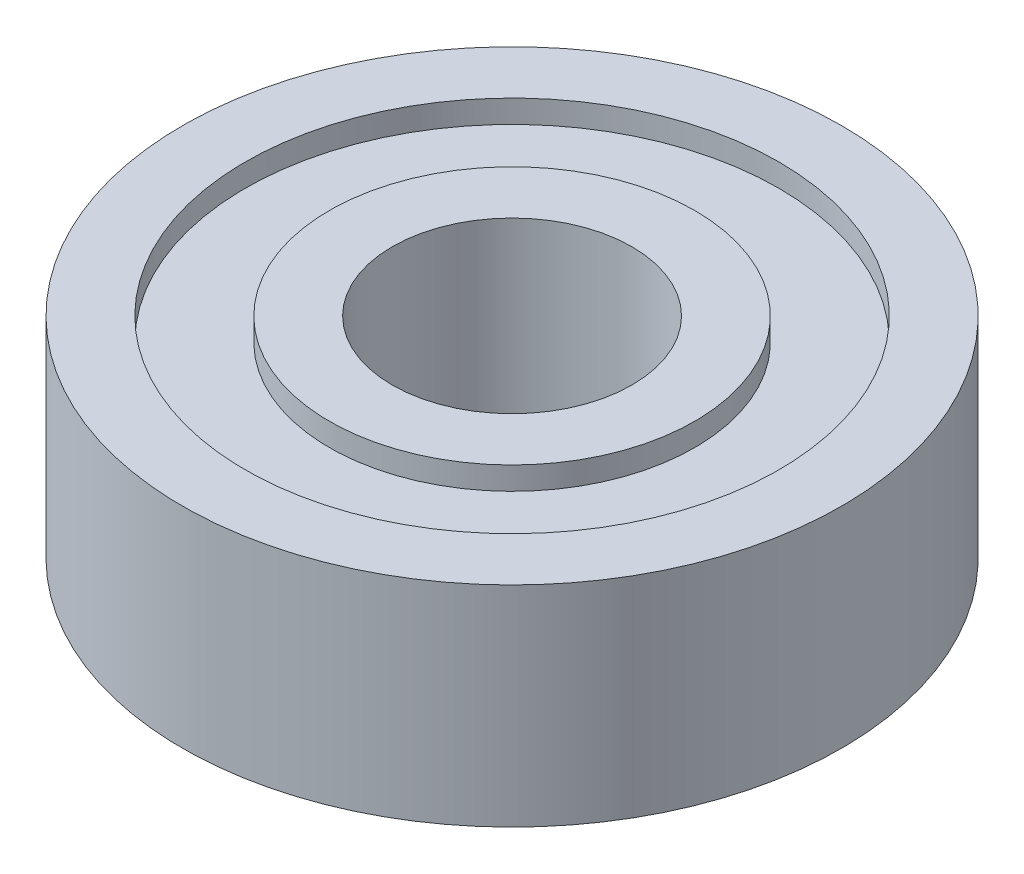
ISO-10303-21;
HEADER;
FILE_DESCRIPTION(('STEP AP214'),'2;1');
FILE_NAME('part.step','',(''),(''),'','','');
FILE_SCHEMA(('AUTOMOTIVE_DESIGN { 1 0 10303 214 1 1 1 1 }'));
ENDSEC;
DATA;
#1=APPLICATION_CONTEXT('core data for automotive mechanical design processes');
#2=APPLICATION_PROTOCOL_DEFINITION('international standard','automotive_design',2000,#1);
#3=PRODUCT_CONTEXT('',#1,'mechanical');
#4=PRODUCT('Part','Part','',(#3));
#5=PRODUCT_RELATED_PRODUCT_CATEGORY('part','',(#4));
#6=PRODUCT_DEFINITION_FORMATION('','',#4);
#7=PRODUCT_DEFINITION_CONTEXT('part definition',#1,'design');
#8=PRODUCT_DEFINITION('design','',#6,#7);
#9=PRODUCT_DEFINITION_SHAPE('','',#8);
#10=(LENGTH_UNIT() NAMED_UNIT(*) SI_UNIT(.MILLI.,.METRE.));
#11=(NAMED_UNIT(*) PLANE_ANGLE_UNIT() SI_UNIT($,.RADIAN.));
#12=(NAMED_UNIT(*) SI_UNIT($,.STERADIAN.) SOLID_ANGLE_UNIT());
#13=UNCERTAINTY_MEASURE_WITH_UNIT(LENGTH_MEASURE(1.E-05),#10,'distance_accuracy_value','');
#14=(GEOMETRIC_REPRESENTATION_CONTEXT(3) GLOBAL_UNCERTAINTY_ASSIGNED_CONTEXT((#13)) GLOBAL_UNIT_ASSIGNED_CONTEXT((#10,
#11,#12)) REPRESENTATION_CONTEXT('',''));
#15=CARTESIAN_POINT('',(0.,0.,0.));
#16=DIRECTION('',(0.,0.,1.));
#17=DIRECTION('',(1.,0.,0.));
#18=AXIS2_PLACEMENT_3D('',#15,#16,#17);
#19=CARTESIAN_POINT('',(6.096,-3.5,0.));
#20=DIRECTION('',(0.,-1.,0.));
#21=DIRECTION('',(0.,0.,-1.));
#22=AXIS2_PLACEMENT_3D('',#19,#20,#21);
#23=PLANE('',#22);
#24=CARTESIAN_POINT('',(0.,-3.5,0.));
#25=DIRECTION('',(0.,-1.,0.));
#26=DIRECTION('',(0.,0.,-1.));
#27=AXIS2_PLACEMENT_3D('',#24,#25,#26);
#28=CIRCLE('',#27,6.096);
#29=CARTESIAN_POINT('',(0.,-3.5,-6.096));
#30=VERTEX_POINT('',#29);
#31=EDGE_CURVE('E10',#30,#30,#28,.T.);
#32=ORIENTED_EDGE('',*,*,#31,.T.);
#33=EDGE_LOOP('',(#32));
#34=FACE_BOUND('',#33,.T.);
#35=CARTESIAN_POINT('',(0.,-3.5,0.));
#36=DIRECTION('',(0.,-1.,0.));
#37=DIRECTION('',(0.,0.,-1.));
#38=AXIS2_PLACEMENT_3D('',#35,#36,#37);
#39=CIRCLE('',#38,4.);
#40=CARTESIAN_POINT('',(0.,-3.5,-4.));
#41=VERTEX_POINT('',#40);
#42=EDGE_CURVE('E76',#41,#41,#39,.T.);
#43=ORIENTED_EDGE('',*,*,#42,.F.);
#44=EDGE_LOOP('',(#43));
#45=FACE_BOUND('',#44,.T.);
#46=ADVANCED_FACE('F36',(#34,#45),#23,.T.);
#47=CARTESIAN_POINT('',(0.,0.,0.));
#48=DIRECTION('',(0.,-1.,0.));
#49=DIRECTION('',(0.,0.,-1.));
#50=AXIS2_PLACEMENT_3D('',#47,#48,#49);
#51=CYLINDRICAL_SURFACE('',#50,6.096);
#52=CARTESIAN_POINT('',(0.,-2.738,0.));
#53=DIRECTION('',(0.,-1.,0.));
#54=DIRECTION('',(0.,0.,-1.));
#55=AXIS2_PLACEMENT_3D('',#52,#53,#54);
#56=CIRCLE('',#55,6.096);
#57=CARTESIAN_POINT('',(0.,-2.738,-6.096));
#58=VERTEX_POINT('',#57);
#59=EDGE_CURVE('E42',#58,#58,#56,.T.);
#60=ORIENTED_EDGE('',*,*,#59,.T.);
#61=EDGE_LOOP('',(#60));
#62=FACE_BOUND('',#61,.T.);
#63=ORIENTED_EDGE('',*,*,#31,.F.);
#64=EDGE_LOOP('',(#63));
#65=FACE_BOUND('',#64,.T.);
#66=ADVANCED_FACE('F84',(#62,#65),#51,.T.);
#67=CARTESIAN_POINT('',(8.904,-2.738,0.));
#68=DIRECTION('',(0.,-1.,0.));
#69=DIRECTION('',(0.,0.,-1.));
#70=AXIS2_PLACEMENT_3D('',#67,#68,#69);
#71=PLANE('',#70);
#72=CARTESIAN_POINT('',(0.,-2.738,0.));
#73=DIRECTION('',(0.,-1.,0.));
#74=DIRECTION('',(0.,0.,-1.));
#75=AXIS2_PLACEMENT_3D('',#72,#73,#74);
#76=CIRCLE('',#75,8.904);
#77=CARTESIAN_POINT('',(0.,-2.738,-8.904));
#78=VERTEX_POINT('',#77);
#79=EDGE_CURVE('E46',#78,#78,#76,.T.);
#80=ORIENTED_EDGE('',*,*,#79,.T.);
#81=EDGE_LOOP('',(#80));
#82=FACE_BOUND('',#81,.T.);
#83=ORIENTED_EDGE('',*,*,#59,.F.);
#84=EDGE_LOOP('',(#83));
#85=FACE_BOUND('',#84,.T.);
#86=ADVANCED_FACE('F88',(#82,#85),#71,.T.);
#87=CARTESIAN_POINT('',(0.,0.,0.));
#88=DIRECTION('',(0.,-1.,0.));
#89=DIRECTION('',(0.,0.,-1.));
#90=AXIS2_PLACEMENT_3D('',#87,#88,#89);
#91=CYLINDRICAL_SURFACE('',#90,8.904);
#92=CARTESIAN_POINT('',(0.,-3.5,0.));
#93=DIRECTION('',(0.,-1.,0.));
#94=DIRECTION('',(0.,0.,-1.));
#95=AXIS2_PLACEMENT_3D('',#92,#93,#94);
#96=CIRCLE('',#95,8.904);
#97=CARTESIAN_POINT('',(0.,-3.5,-8.904));
#98=VERTEX_POINT('',#97);
#99=EDGE_CURVE('E50',#98,#98,#96,.T.);
#100=ORIENTED_EDGE('',*,*,#99,.T.);
#101=EDGE_LOOP('',(#100));
#102=FACE_BOUND('',#101,.T.);
#103=ORIENTED_EDGE('',*,*,#79,.F.);
#104=EDGE_LOOP('',(#103));
#105=FACE_BOUND('',#104,.T.);
#106=ADVANCED_FACE('F92',(#102,#105),#91,.F.);
#107=CARTESIAN_POINT('',(11.,-3.5,0.));
#108=DIRECTION('',(0.,-1.,0.));
#109=DIRECTION('',(0.,0.,-1.));
#110=AXIS2_PLACEMENT_3D('',#107,#108,#109);
#111=PLANE('',#110);
#112=CARTESIAN_POINT('',(0.,-3.5,0.));
#113=DIRECTION('',(0.,-1.,0.));
#114=DIRECTION('',(0.,0.,-1.));
#115=AXIS2_PLACEMENT_3D('',#112,#113,#114);
#116=CIRCLE('',#115,11.);
#117=CARTESIAN_POINT('',(0.,-3.5,-11.));
#118=VERTEX_POINT('',#117);
#119=EDGE_CURVE('E55',#118,#118,#116,.T.);
#120=ORIENTED_EDGE('',*,*,#119,.T.);
#121=EDGE_LOOP('',(#120));
#122=FACE_BOUND('',#121,.T.);
#123=ORIENTED_EDGE('',*,*,#99,.F.);
#124=EDGE_LOOP('',(#123));
#125=FACE_BOUND('',#124,.T.);
#126=ADVANCED_FACE('F99',(#122,#125),#111,.T.);
#127=CARTESIAN_POINT('',(0.,0.,0.));
#128=DIRECTION('',(0.,-1.,0.));
#129=DIRECTION('',(0.,0.,-1.));
#130=AXIS2_PLACEMENT_3D('',#127,#128,#129);
#131=CYLINDRICAL_SURFACE('',#130,11.);
#132=CARTESIAN_POINT('',(0.,3.5,0.));
#133=DIRECTION('',(0.,-1.,0.));
#134=DIRECTION('',(0.,0.,-1.));
#135=AXIS2_PLACEMENT_3D('',#132,#133,#134);
#136=CIRCLE('',#135,11.);
#137=CARTESIAN_POINT('',(0.,3.5,-11.));
#138=VERTEX_POINT('',#137);
#139=EDGE_CURVE('E58',#138,#138,#136,.T.);
#140=ORIENTED_EDGE('',*,*,#139,.T.);
#141=EDGE_LOOP('',(#140));
#142=FACE_BOUND('',#141,.T.);
#143=ORIENTED_EDGE('',*,*,#119,.F.);
#144=EDGE_LOOP('',(#143));
#145=FACE_BOUND('',#144,.T.);
#146=ADVANCED_FACE('F103',(#142,#145),#131,.T.);
#147=CARTESIAN_POINT('',(11.,3.5,0.));
#148=DIRECTION('',(0.,1.,0.));
#149=DIRECTION('',(0.,0.,1.));
#150=AXIS2_PLACEMENT_3D('',#147,#148,#149);
#151=PLANE('',#150);
#152=CARTESIAN_POINT('',(0.,3.5,0.));
#153=DIRECTION('',(0.,-1.,0.));
#154=DIRECTION('',(0.,0.,-1.));
#155=AXIS2_PLACEMENT_3D('',#152,#153,#154);
#156=CIRCLE('',#155,8.904);
#157=CARTESIAN_POINT('',(0.,3.5,-8.904));
#158=VERTEX_POINT('',#157);
#159=EDGE_CURVE('E61',#158,#158,#156,.T.);
#160=ORIENTED_EDGE('',*,*,#159,.T.);
#161=EDGE_LOOP('',(#160));
#162=FACE_BOUND('',#161,.T.);
#163=ORIENTED_EDGE('',*,*,#139,.F.);
#164=EDGE_LOOP('',(#163));
#165=FACE_BOUND('',#164,.T.);
#166=ADVANCED_FACE('F107',(#162,#165),#151,.T.);
#167=CARTESIAN_POINT('',(0.,0.,0.));
#168=DIRECTION('',(0.,-1.,0.));
#169=DIRECTION('',(0.,0.,-1.));
#170=AXIS2_PLACEMENT_3D('',#167,#168,#169);
#171=CYLINDRICAL_SURFACE('',#170,8.904);
#172=CARTESIAN_POINT('',(0.,2.738,0.));
#173=DIRECTION('',(0.,-1.,0.));
#174=DIRECTION('',(0.,0.,-1.));
#175=AXIS2_PLACEMENT_3D('',#172,#173,#174);
#176=CIRCLE('',#175,8.904);
#177=CARTESIAN_POINT('',(0.,2.738,-8.904));
#178=VERTEX_POINT('',#177);
#179=EDGE_CURVE('E64',#178,#178,#176,.T.);
#180=ORIENTED_EDGE('',*,*,#179,.T.);
#181=EDGE_LOOP('',(#180));
#182=FACE_BOUND('',#181,.T.);
#183=ORIENTED_EDGE('',*,*,#159,.F.);
#184=EDGE_LOOP('',(#183));
#185=FACE_BOUND('',#184,.T.);
#186=ADVANCED_FACE('F111',(#182,#185),#171,.F.);
#187=CARTESIAN_POINT('',(8.904,2.738,0.));
#188=DIRECTION('',(0.,1.,0.));
#189=DIRECTION('',(0.,0.,1.));
#190=AXIS2_PLACEMENT_3D('',#187,#188,#189);
#191=PLANE('',#190);
#192=CARTESIAN_POINT('',(0.,2.738,0.));
#193=DIRECTION('',(0.,-1.,0.));
#194=DIRECTION('',(0.,0.,-1.));
#195=AXIS2_PLACEMENT_3D('',#192,#193,#194);
#196=CIRCLE('',#195,6.096);
#197=CARTESIAN_POINT('',(0.,2.738,-6.096));
#198=VERTEX_POINT('',#197);
#199=EDGE_CURVE('E67',#198,#198,#196,.T.);
#200=ORIENTED_EDGE('',*,*,#199,.T.);
#201=EDGE_LOOP('',(#200));
#202=FACE_BOUND('',#201,.T.);
#203=ORIENTED_EDGE('',*,*,#179,.F.);
#204=EDGE_LOOP('',(#203));
#205=FACE_BOUND('',#204,.T.);
#206=ADVANCED_FACE('F115',(#202,#205),#191,.T.);
#207=CARTESIAN_POINT('',(0.,0.,0.));
#208=DIRECTION('',(0.,-1.,0.));
#209=DIRECTION('',(0.,0.,-1.));
#210=AXIS2_PLACEMENT_3D('',#207,#208,#209);
#211=CYLINDRICAL_SURFACE('',#210,6.096);
#212=CARTESIAN_POINT('',(0.,3.5,0.));
#213=DIRECTION('',(0.,-1.,0.));
#214=DIRECTION('',(0.,0.,-1.));
#215=AXIS2_PLACEMENT_3D('',#212,#213,#214);
#216=CIRCLE('',#215,6.096);
#217=CARTESIAN_POINT('',(0.,3.5,-6.096));
#218=VERTEX_POINT('',#217);
#219=EDGE_CURVE('E70',#218,#218,#216,.T.);
#220=ORIENTED_EDGE('',*,*,#219,.T.);
#221=EDGE_LOOP('',(#220));
#222=FACE_BOUND('',#221,.T.);
#223=ORIENTED_EDGE('',*,*,#199,.F.);
#224=EDGE_LOOP('',(#223));
#225=FACE_BOUND('',#224,.T.);
#226=ADVANCED_FACE('F119',(#222,#225),#211,.T.);
#227=CARTESIAN_POINT('',(6.096,3.5,0.));
#228=DIRECTION('',(0.,1.,0.));
#229=DIRECTION('',(0.,0.,1.));
#230=AXIS2_PLACEMENT_3D('',#227,#228,#229);
#231=PLANE('',#230);
#232=CARTESIAN_POINT('',(0.,3.5,0.));
#233=DIRECTION('',(0.,-1.,0.));
#234=DIRECTION('',(0.,0.,-1.));
#235=AXIS2_PLACEMENT_3D('',#232,#233,#234);
#236=CIRCLE('',#235,4.);
#237=CARTESIAN_POINT('',(0.,3.5,-4.));
#238=VERTEX_POINT('',#237);
#239=EDGE_CURVE('E73',#238,#238,#236,.T.);
#240=ORIENTED_EDGE('',*,*,#239,.T.);
#241=EDGE_LOOP('',(#240));
#242=FACE_BOUND('',#241,.T.);
#243=ORIENTED_EDGE('',*,*,#219,.F.);
#244=EDGE_LOOP('',(#243));
#245=FACE_BOUND('',#244,.T.);
#246=ADVANCED_FACE('F123',(#242,#245),#231,.T.);
#247=CARTESIAN_POINT('',(0.,0.,0.));
#248=DIRECTION('',(0.,-1.,0.));
#249=DIRECTION('',(0.,0.,-1.));
#250=AXIS2_PLACEMENT_3D('',#247,#248,#249);
#251=CYLINDRICAL_SURFACE('',#250,4.);
#252=ORIENTED_EDGE('',*,*,#42,.T.);
#253=EDGE_LOOP('',(#252));
#254=FACE_BOUND('',#253,.T.);
#255=ORIENTED_EDGE('',*,*,#239,.F.);
#256=EDGE_LOOP('',(#255));
#257=FACE_BOUND('',#256,.T.);
#258=ADVANCED_FACE('F80',(#254,#257),#251,.F.);
#259=CLOSED_SHELL('',(#46,#66,#86,#106,#126,#146,#166,#186,#206,#226,#246,#258));
#260=MANIFOLD_SOLID_BREP('B2',#259);
#261=ADVANCED_BREP_SHAPE_REPRESENTATION('',(#18,#260),#14);
#262=SHAPE_DEFINITION_REPRESENTATION(#9,#261);
ENDSEC;
END-ISO-10303-21;
